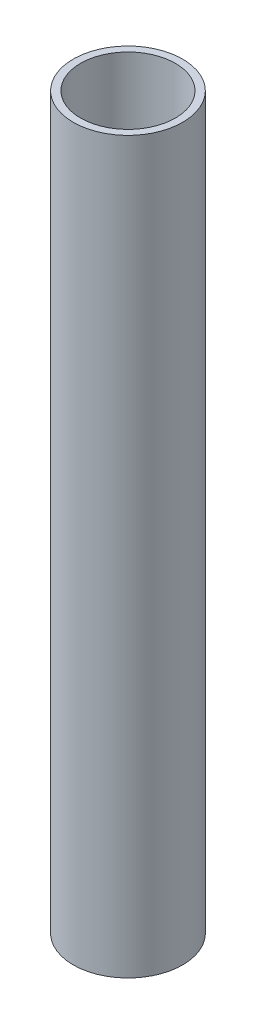
ISO-10303-21;
HEADER;
FILE_DESCRIPTION(('STEP AP214'),'2;1');
FILE_NAME('part.step','',(''),(''),'','','');
FILE_SCHEMA(('AUTOMOTIVE_DESIGN { 1 0 10303 214 1 1 1 1 }'));
ENDSEC;
DATA;
#1=APPLICATION_CONTEXT('core data for automotive mechanical design processes');
#2=APPLICATION_PROTOCOL_DEFINITION('international standard','automotive_design',2000,#1);
#3=PRODUCT_CONTEXT('',#1,'mechanical');
#4=PRODUCT('Part','Part','',(#3));
#5=PRODUCT_RELATED_PRODUCT_CATEGORY('part','',(#4));
#6=PRODUCT_DEFINITION_FORMATION('','',#4);
#7=PRODUCT_DEFINITION_CONTEXT('part definition',#1,'design');
#8=PRODUCT_DEFINITION('design','',#6,#7);
#9=PRODUCT_DEFINITION_SHAPE('','',#8);
#10=(LENGTH_UNIT() NAMED_UNIT(*) SI_UNIT(.MILLI.,.METRE.));
#11=(NAMED_UNIT(*) PLANE_ANGLE_UNIT() SI_UNIT($,.RADIAN.));
#12=(NAMED_UNIT(*) SI_UNIT($,.STERADIAN.) SOLID_ANGLE_UNIT());
#13=UNCERTAINTY_MEASURE_WITH_UNIT(LENGTH_MEASURE(1.E-05),#10,'distance_accuracy_value','');
#14=(GEOMETRIC_REPRESENTATION_CONTEXT(3) GLOBAL_UNCERTAINTY_ASSIGNED_CONTEXT((#13)) GLOBAL_UNIT_ASSIGNED_CONTEXT((#10,
#11,#12)) REPRESENTATION_CONTEXT('',''));
#15=CARTESIAN_POINT('',(0.,0.,0.));
#16=DIRECTION('',(0.,0.,1.));
#17=DIRECTION('',(1.,0.,0.));
#18=AXIS2_PLACEMENT_3D('',#15,#16,#17);
#19=CARTESIAN_POINT('',(0.,100.,0.));
#20=DIRECTION('',(0.,1.,0.));
#21=DIRECTION('',(0.,0.,1.));
#22=AXIS2_PLACEMENT_3D('',#19,#20,#21);
#23=PLANE('',#22);
#24=CARTESIAN_POINT('',(0.,100.,0.));
#25=DIRECTION('',(0.,1.,0.));
#26=DIRECTION('',(0.,0.,1.));
#27=AXIS2_PLACEMENT_3D('',#24,#25,#26);
#28=CIRCLE('',#27,7.5);
#29=CARTESIAN_POINT('',(0.,100.,7.5));
#30=VERTEX_POINT('',#29);
#31=EDGE_CURVE('E10',#30,#30,#28,.T.);
#32=ORIENTED_EDGE('',*,*,#31,.T.);
#33=EDGE_LOOP('',(#32));
#34=FACE_BOUND('',#33,.T.);
#35=CARTESIAN_POINT('',(0.,100.,0.));
#36=DIRECTION('',(0.,1.,0.));
#37=DIRECTION('',(0.,0.,1.));
#38=AXIS2_PLACEMENT_3D('',#35,#36,#37);
#39=CIRCLE('',#38,6.5);
#40=CARTESIAN_POINT('',(0.,100.,6.5));
#41=VERTEX_POINT('',#40);
#42=EDGE_CURVE('E42',#41,#41,#39,.T.);
#43=ORIENTED_EDGE('',*,*,#42,.F.);
#44=EDGE_LOOP('',(#43));
#45=FACE_BOUND('',#44,.T.);
#46=ADVANCED_FACE('F31',(#34,#45),#23,.T.);
#47=CARTESIAN_POINT('',(0.,0.,0.));
#48=DIRECTION('',(0.,1.,0.));
#49=DIRECTION('',(0.,0.,1.));
#50=AXIS2_PLACEMENT_3D('',#47,#48,#49);
#51=PLANE('',#50);
#52=CARTESIAN_POINT('',(0.,0.,0.));
#53=DIRECTION('',(0.,1.,0.));
#54=DIRECTION('',(0.,0.,1.));
#55=AXIS2_PLACEMENT_3D('',#52,#53,#54);
#56=CIRCLE('',#55,7.5);
#57=CARTESIAN_POINT('',(0.,0.,7.5));
#58=VERTEX_POINT('',#57);
#59=EDGE_CURVE('E35',#58,#58,#56,.T.);
#60=ORIENTED_EDGE('',*,*,#59,.F.);
#61=EDGE_LOOP('',(#60));
#62=FACE_BOUND('',#61,.T.);
#63=CARTESIAN_POINT('',(0.,0.,0.));
#64=DIRECTION('',(0.,1.,0.));
#65=DIRECTION('',(0.,0.,1.));
#66=AXIS2_PLACEMENT_3D('',#63,#64,#65);
#67=CIRCLE('',#66,6.5);
#68=CARTESIAN_POINT('',(0.,0.,6.5));
#69=VERTEX_POINT('',#68);
#70=EDGE_CURVE('E44',#69,#69,#67,.T.);
#71=ORIENTED_EDGE('',*,*,#70,.T.);
#72=EDGE_LOOP('',(#71));
#73=FACE_BOUND('',#72,.T.);
#74=ADVANCED_FACE('F54',(#62,#73),#51,.F.);
#75=CARTESIAN_POINT('',(0.,100.,0.));
#76=DIRECTION('',(0.,-1.,0.));
#77=DIRECTION('',(0.,0.,-1.));
#78=AXIS2_PLACEMENT_3D('',#75,#76,#77);
#79=CYLINDRICAL_SURFACE('',#78,7.5);
#80=ORIENTED_EDGE('',*,*,#31,.F.);
#81=EDGE_LOOP('',(#80));
#82=FACE_BOUND('',#81,.T.);
#83=ORIENTED_EDGE('',*,*,#59,.T.);
#84=EDGE_LOOP('',(#83));
#85=FACE_BOUND('',#84,.T.);
#86=ADVANCED_FACE('F33',(#82,#85),#79,.T.);
#87=CARTESIAN_POINT('',(0.,100.,0.));
#88=DIRECTION('',(0.,-1.,0.));
#89=DIRECTION('',(0.,0.,-1.));
#90=AXIS2_PLACEMENT_3D('',#87,#88,#89);
#91=CYLINDRICAL_SURFACE('',#90,6.5);
#92=ORIENTED_EDGE('',*,*,#42,.T.);
#93=EDGE_LOOP('',(#92));
#94=FACE_BOUND('',#93,.T.);
#95=ORIENTED_EDGE('',*,*,#70,.F.);
#96=EDGE_LOOP('',(#95));
#97=FACE_BOUND('',#96,.T.);
#98=ADVANCED_FACE('F50',(#94,#97),#91,.F.);
#99=CLOSED_SHELL('',(#46,#74,#86,#98));
#100=MANIFOLD_SOLID_BREP('B2',#99);
#101=ADVANCED_BREP_SHAPE_REPRESENTATION('',(#18,#100),#14);
#102=SHAPE_DEFINITION_REPRESENTATION(#9,#101);
ENDSEC;
END-ISO-10303-21;
